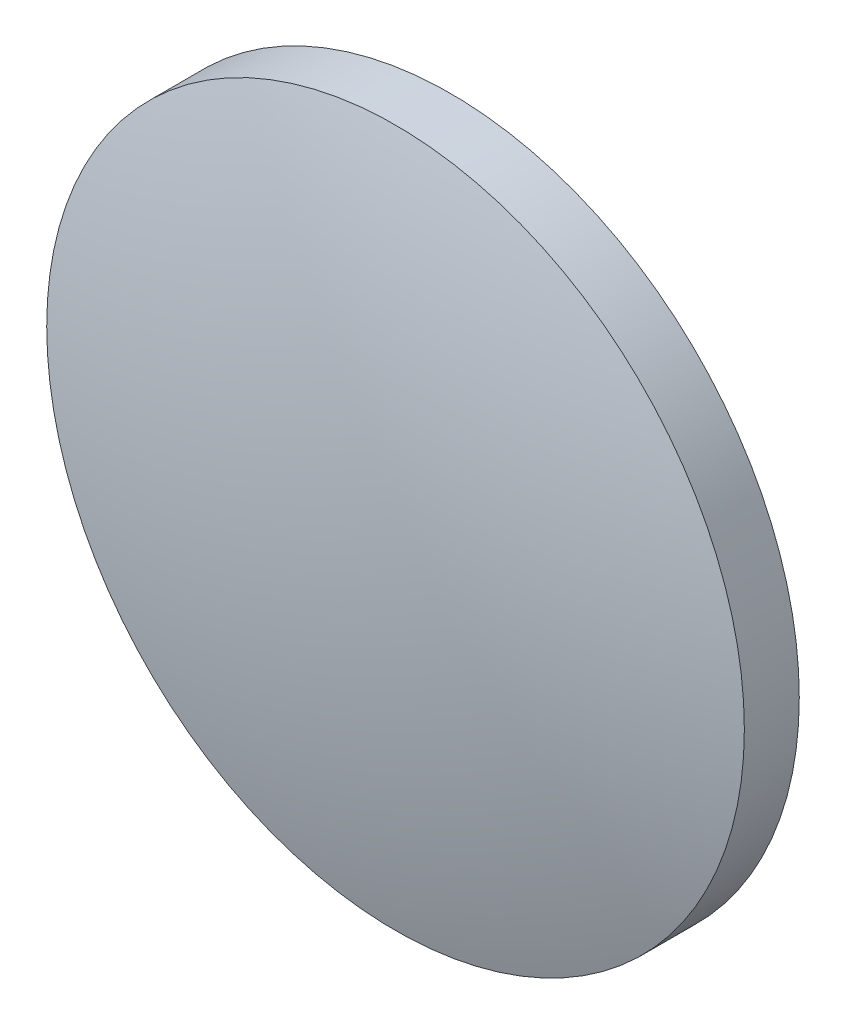
ISO-10303-21;
HEADER;
FILE_DESCRIPTION(('STEP AP214'),'2;1');
FILE_NAME('part.step','',(''),(''),'','','');
FILE_SCHEMA(('AUTOMOTIVE_DESIGN { 1 0 10303 214 1 1 1 1 }'));
ENDSEC;
DATA;
#1=APPLICATION_CONTEXT('core data for automotive mechanical design processes');
#2=APPLICATION_PROTOCOL_DEFINITION('international standard','automotive_design',2000,#1);
#3=PRODUCT_CONTEXT('',#1,'mechanical');
#4=PRODUCT('Part','Part','',(#3));
#5=PRODUCT_RELATED_PRODUCT_CATEGORY('part','',(#4));
#6=PRODUCT_DEFINITION_FORMATION('','',#4);
#7=PRODUCT_DEFINITION_CONTEXT('part definition',#1,'design');
#8=PRODUCT_DEFINITION('design','',#6,#7);
#9=PRODUCT_DEFINITION_SHAPE('','',#8);
#10=(LENGTH_UNIT() NAMED_UNIT(*) SI_UNIT(.MILLI.,.METRE.));
#11=(NAMED_UNIT(*) PLANE_ANGLE_UNIT() SI_UNIT($,.RADIAN.));
#12=(NAMED_UNIT(*) SI_UNIT($,.STERADIAN.) SOLID_ANGLE_UNIT());
#13=UNCERTAINTY_MEASURE_WITH_UNIT(LENGTH_MEASURE(1.E-05),#10,'distance_accuracy_value','');
#14=(GEOMETRIC_REPRESENTATION_CONTEXT(3) GLOBAL_UNCERTAINTY_ASSIGNED_CONTEXT((#13)) GLOBAL_UNIT_ASSIGNED_CONTEXT((#10,
#11,#12)) REPRESENTATION_CONTEXT('',''));
#15=CARTESIAN_POINT('',(0.,0.,0.));
#16=DIRECTION('',(0.,0.,1.));
#17=DIRECTION('',(1.,0.,0.));
#18=AXIS2_PLACEMENT_3D('',#15,#16,#17);
#19=CARTESIAN_POINT('',(-0.00872822977051116,0.,-44.1149991721148));
#20=DIRECTION('',(0.,-1.,0.));
#21=DIRECTION('',(1.,0.,0.));
#22=AXIS2_PLACEMENT_3D('',#19,#20,#21);
#23=CIRCLE('',#22,46.01);
#24=TRIMMED_CURVE('',#23,(PARAMETER_VALUE(-1.57060662390807)),
(PARAMETER_VALUE(1.57060662390807)),.T.,.PARAMETER.);
#25=CARTESIAN_POINT('',(0.,0.,-44.1149991721148));
#26=DIRECTION('',(0.,0.,1.));
#27=AXIS1_PLACEMENT('',#25,#26);
#28=SURFACE_OF_REVOLUTION('',#24,#27);
#29=CARTESIAN_POINT('',(0.,0.,1.895));
#30=VERTEX_POINT('',#29);
#31=VERTEX_LOOP('',#30);
#32=FACE_BOUND('',#31,.T.);
#33=CARTESIAN_POINT('',(0.,0.,0.105000000000001));
#34=DIRECTION('',(0.,0.,1.));
#35=DIRECTION('',(1.,0.,0.));
#36=AXIS2_PLACEMENT_3D('',#33,#34,#35);
#37=CIRCLE('',#36,12.7);
#38=CARTESIAN_POINT('',(12.7,0.,0.105000000000001));
#39=VERTEX_POINT('',#38);
#40=EDGE_CURVE('E21',#39,#39,#37,.T.);
#41=ORIENTED_EDGE('',*,*,#40,.T.);
#42=EDGE_LOOP('',(#41));
#43=FACE_BOUND('',#42,.T.);
#44=ADVANCED_FACE('F15',(#32,#43),#28,.T.);
#45=CARTESIAN_POINT('',(0.,0.,-1.895));
#46=DIRECTION('',(0.,0.,1.));
#47=DIRECTION('',(1.,0.,0.));
#48=AXIS2_PLACEMENT_3D('',#45,#46,#47);
#49=PLANE('',#48);
#50=CARTESIAN_POINT('',(0.,0.,-1.895));
#51=DIRECTION('',(0.,0.,1.));
#52=DIRECTION('',(1.,0.,0.));
#53=AXIS2_PLACEMENT_3D('',#50,#51,#52);
#54=CIRCLE('',#53,12.7);
#55=CARTESIAN_POINT('',(12.7,0.,-1.895));
#56=VERTEX_POINT('',#55);
#57=EDGE_CURVE('E10',#56,#56,#54,.T.);
#58=ORIENTED_EDGE('',*,*,#57,.F.);
#59=EDGE_LOOP('',(#58));
#60=FACE_BOUND('',#59,.T.);
#61=ADVANCED_FACE('F26',(#60),#49,.F.);
#62=CARTESIAN_POINT('',(0.,0.,35.7225457687));
#63=DIRECTION('',(0.,0.,1.));
#64=DIRECTION('',(1.,0.,0.));
#65=AXIS2_PLACEMENT_3D('',#62,#63,#64);
#66=CYLINDRICAL_SURFACE('',#65,12.7);
#67=ORIENTED_EDGE('',*,*,#40,.F.);
#68=EDGE_LOOP('',(#67));
#69=FACE_BOUND('',#68,.T.);
#70=ORIENTED_EDGE('',*,*,#57,.T.);
#71=EDGE_LOOP('',(#70));
#72=FACE_BOUND('',#71,.T.);
#73=ADVANCED_FACE('F30',(#69,#72),#66,.T.);
#74=CLOSED_SHELL('',(#44,#61,#73));
#75=MANIFOLD_SOLID_BREP('B1',#74);
#76=ADVANCED_BREP_SHAPE_REPRESENTATION('',(#18,#75),#14);
#77=SHAPE_DEFINITION_REPRESENTATION(#9,#76);
ENDSEC;
END-ISO-10303-21;
